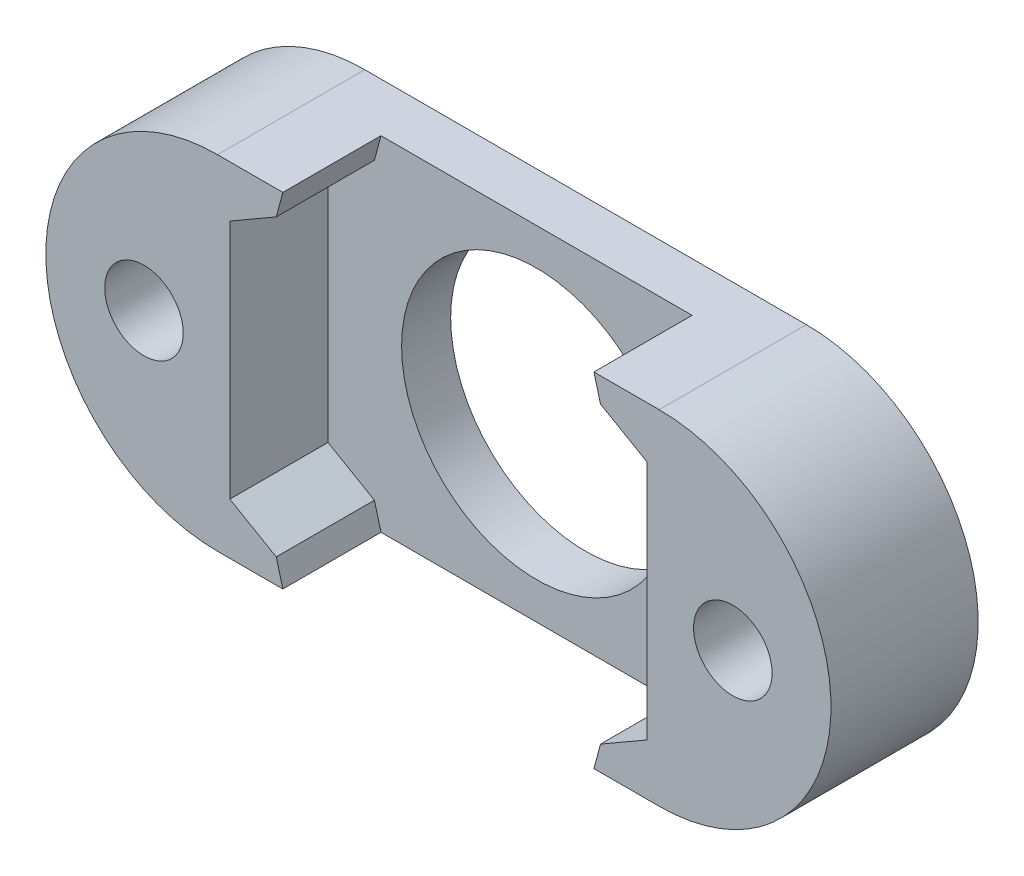
ISO-10303-21;
HEADER;
FILE_DESCRIPTION(('STEP AP214'),'2;1');
FILE_NAME('part.step','',(''),(''),'','','');
FILE_SCHEMA(('AUTOMOTIVE_DESIGN { 1 0 10303 214 1 1 1 1 }'));
ENDSEC;
DATA;
#1=APPLICATION_CONTEXT('core data for automotive mechanical design processes');
#2=APPLICATION_PROTOCOL_DEFINITION('international standard','automotive_design',2000,#1);
#3=PRODUCT_CONTEXT('',#1,'mechanical');
#4=PRODUCT('Part','Part','',(#3));
#5=PRODUCT_RELATED_PRODUCT_CATEGORY('part','',(#4));
#6=PRODUCT_DEFINITION_FORMATION('','',#4);
#7=PRODUCT_DEFINITION_CONTEXT('part definition',#1,'design');
#8=PRODUCT_DEFINITION('design','',#6,#7);
#9=PRODUCT_DEFINITION_SHAPE('','',#8);
#10=(LENGTH_UNIT() NAMED_UNIT(*) SI_UNIT(.MILLI.,.METRE.));
#11=(NAMED_UNIT(*) PLANE_ANGLE_UNIT() SI_UNIT($,.RADIAN.));
#12=(NAMED_UNIT(*) SI_UNIT($,.STERADIAN.) SOLID_ANGLE_UNIT());
#13=UNCERTAINTY_MEASURE_WITH_UNIT(LENGTH_MEASURE(1.E-05),#10,'distance_accuracy_value','');
#14=(GEOMETRIC_REPRESENTATION_CONTEXT(3) GLOBAL_UNCERTAINTY_ASSIGNED_CONTEXT((#13)) GLOBAL_UNIT_ASSIGNED_CONTEXT((#10,
#11,#12)) REPRESENTATION_CONTEXT('',''));
#15=CARTESIAN_POINT('',(0.,0.,0.));
#16=DIRECTION('',(0.,0.,1.));
#17=DIRECTION('',(1.,0.,0.));
#18=AXIS2_PLACEMENT_3D('',#15,#16,#17);
#19=CARTESIAN_POINT('',(-27.2541785109983,0.,6.));
#20=DIRECTION('',(0.,0.,1.));
#21=DIRECTION('',(1.,0.,0.));
#22=AXIS2_PLACEMENT_3D('',#19,#20,#21);
#23=PLANE('',#22);
#24=DIRECTION('',(1.,0.,0.));
#25=VECTOR('',#24,1.);
#26=CARTESIAN_POINT('',(-27.2541785109983,-7.,6.));
#27=LINE('',#26,#25);
#28=CARTESIAN_POINT('',(-27.2541785109983,-7.,6.));
#29=VERTEX_POINT('',#28);
#30=CARTESIAN_POINT('',(-24.5939244731539,-7.,6.));
#31=VERTEX_POINT('',#30);
#32=EDGE_CURVE('E224',#29,#31,#27,.T.);
#33=ORIENTED_EDGE('',*,*,#32,.T.);
#34=DIRECTION('',(0.258819045102524,-0.965925826289068,0.));
#35=VECTOR('',#34,1.);
#36=CARTESIAN_POINT('',(-26.5221277034295,0.196152422706628,6.));
#37=LINE('',#36,#35);
#38=CARTESIAN_POINT('',(-24.8618736655851,-6.,6.));
#39=VERTEX_POINT('',#38);
#40=EDGE_CURVE('E276',#31,#39,#37,.F.);
#41=ORIENTED_EDGE('',*,*,#40,.T.);
#42=DIRECTION('',(0.866025403784438,-0.5,0.));
#43=VECTOR('',#42,1.);
#44=CARTESIAN_POINT('',(-26.7541785109983,-4.90747728811182,6.));
#45=LINE('',#44,#43);
#46=CARTESIAN_POINT('',(-26.7541785109983,-4.90747728811182,6.));
#47=VERTEX_POINT('',#46);
#48=EDGE_CURVE('E155',#47,#39,#45,.T.);
#49=ORIENTED_EDGE('',*,*,#48,.F.);
#50=DIRECTION('',(0.,-1.,0.));
#51=VECTOR('',#50,1.);
#52=CARTESIAN_POINT('',(-26.7541785109983,4.90747728811182,6.));
#53=LINE('',#52,#51);
#54=CARTESIAN_POINT('',(-26.7541785109983,4.90747728811182,6.));
#55=VERTEX_POINT('',#54);
#56=EDGE_CURVE('E188',#55,#47,#53,.T.);
#57=ORIENTED_EDGE('',*,*,#56,.F.);
#58=DIRECTION('',(-0.866025403784439,-0.5,0.));
#59=VECTOR('',#58,1.);
#60=CARTESIAN_POINT('',(-18.2541785109983,9.81495457622364,6.));
#61=LINE('',#60,#59);
#62=CARTESIAN_POINT('',(-24.861873665585,6.00000000000001,6.));
#63=VERTEX_POINT('',#62);
#64=EDGE_CURVE('E186',#63,#55,#61,.T.);
#65=ORIENTED_EDGE('',*,*,#64,.F.);
#66=DIRECTION('',(-0.258819045102523,-0.965925826289068,0.));
#67=VECTOR('',#66,1.);
#68=CARTESIAN_POINT('',(-26.5221277034294,-0.196152422706632,6.));
#69=LINE('',#68,#67);
#70=CARTESIAN_POINT('',(-24.5939244731539,7.,6.));
#71=VERTEX_POINT('',#70);
#72=EDGE_CURVE('E274',#63,#71,#69,.F.);
#73=ORIENTED_EDGE('',*,*,#72,.T.);
#74=DIRECTION('',(-1.,0.,0.));
#75=VECTOR('',#74,1.);
#76=CARTESIAN_POINT('',(-27.2541785109983,7.,6.));
#77=LINE('',#76,#75);
#78=CARTESIAN_POINT('',(-27.2541785109983,7.,6.));
#79=VERTEX_POINT('',#78);
#80=EDGE_CURVE('E229',#71,#79,#77,.T.);
#81=ORIENTED_EDGE('',*,*,#80,.T.);
#82=CARTESIAN_POINT('',(-27.2541785109983,0.,6.));
#83=DIRECTION('',(0.,0.,1.));
#84=DIRECTION('',(1.,0.,0.));
#85=AXIS2_PLACEMENT_3D('',#82,#83,#84);
#86=CIRCLE('',#85,7.);
#87=EDGE_CURVE('E219',#79,#29,#86,.T.);
#88=ORIENTED_EDGE('',*,*,#87,.T.);
#89=EDGE_LOOP('',(#33,#41,#49,#57,#65,#73,#81,#88));
#90=FACE_BOUND('',#89,.T.);
#91=CARTESIAN_POINT('',(-30.2541785109983,0.,6.));
#92=DIRECTION('',(0.,0.,1.));
#93=DIRECTION('',(1.,0.,0.));
#94=AXIS2_PLACEMENT_3D('',#91,#92,#93);
#95=CIRCLE('',#94,1.60000000000001);
#96=CARTESIAN_POINT('',(-28.6541785109983,0.,6.));
#97=VERTEX_POINT('',#96);
#98=EDGE_CURVE('E207',#97,#97,#95,.T.);
#99=ORIENTED_EDGE('',*,*,#98,.F.);
#100=EDGE_LOOP('',(#99));
#101=FACE_BOUND('',#100,.T.);
#102=ADVANCED_FACE('F33',(#90,#101),#23,.T.);
#103=CARTESIAN_POINT('',(-18.2541785109983,0.,0.));
#104=DIRECTION('',(0.,0.,1.));
#105=DIRECTION('',(1.,0.,0.));
#106=AXIS2_PLACEMENT_3D('',#103,#104,#105);
#107=CYLINDRICAL_SURFACE('',#106,5.5);
#108=CARTESIAN_POINT('',(-18.2541785109983,0.,0.));
#109=DIRECTION('',(0.,0.,1.));
#110=DIRECTION('',(1.,0.,0.));
#111=AXIS2_PLACEMENT_3D('',#108,#109,#110);
#112=CIRCLE('',#111,5.5);
#113=CARTESIAN_POINT('',(-12.7541785109983,0.,0.));
#114=VERTEX_POINT('',#113);
#115=EDGE_CURVE('E213',#114,#114,#112,.T.);
#116=ORIENTED_EDGE('',*,*,#115,.F.);
#117=EDGE_LOOP('',(#116));
#118=FACE_BOUND('',#117,.T.);
#119=CARTESIAN_POINT('',(-18.2541785109983,0.,2.));
#120=DIRECTION('',(0.,0.,1.));
#121=DIRECTION('',(1.,0.,0.));
#122=AXIS2_PLACEMENT_3D('',#119,#120,#121);
#123=CIRCLE('',#122,5.5);
#124=CARTESIAN_POINT('',(-12.7541785109983,0.,2.));
#125=VERTEX_POINT('',#124);
#126=EDGE_CURVE('E194',#125,#125,#123,.F.);
#127=ORIENTED_EDGE('',*,*,#126,.F.);
#128=EDGE_LOOP('',(#127));
#129=FACE_BOUND('',#128,.T.);
#130=ADVANCED_FACE('F354',(#118,#129),#107,.F.);
#131=CARTESIAN_POINT('',(-27.2541785109983,0.,6.));
#132=DIRECTION('',(0.,0.,-1.));
#133=DIRECTION('',(-1.,0.,0.));
#134=AXIS2_PLACEMENT_3D('',#131,#132,#133);
#135=CYLINDRICAL_SURFACE('',#134,7.);
#136=CARTESIAN_POINT('',(-27.2541785109983,0.,0.));
#137=DIRECTION('',(0.,0.,1.));
#138=DIRECTION('',(1.,0.,0.));
#139=AXIS2_PLACEMENT_3D('',#136,#137,#138);
#140=CIRCLE('',#139,7.);
#141=CARTESIAN_POINT('',(-27.2541785109983,7.,0.));
#142=VERTEX_POINT('',#141);
#143=CARTESIAN_POINT('',(-27.2541785109983,-7.,0.));
#144=VERTEX_POINT('',#143);
#145=EDGE_CURVE('E218',#142,#144,#140,.T.);
#146=ORIENTED_EDGE('',*,*,#145,.T.);
#147=DIRECTION('',(0.,0.,-1.));
#148=VECTOR('',#147,1.);
#149=CARTESIAN_POINT('',(-27.2541785109983,-7.,6.));
#150=LINE('',#149,#148);
#151=EDGE_CURVE('E249',#29,#144,#150,.T.);
#152=ORIENTED_EDGE('',*,*,#151,.F.);
#153=ORIENTED_EDGE('',*,*,#87,.F.);
#154=DIRECTION('',(0.,0.,-1.));
#155=VECTOR('',#154,1.);
#156=CARTESIAN_POINT('',(-27.2541785109983,7.,6.));
#157=LINE('',#156,#155);
#158=EDGE_CURVE('E233',#79,#142,#157,.T.);
#159=ORIENTED_EDGE('',*,*,#158,.T.);
#160=EDGE_LOOP('',(#146,#152,#153,#159));
#161=FACE_BOUND('',#160,.T.);
#162=ADVANCED_FACE('F300',(#161),#135,.T.);
#163=CARTESIAN_POINT('',(-27.2541785109983,-7.,6.));
#164=DIRECTION('',(0.,1.,0.));
#165=DIRECTION('',(0.,0.,1.));
#166=AXIS2_PLACEMENT_3D('',#163,#164,#165);
#167=PLANE('',#166);
#168=CARTESIAN_POINT('',(-11.9144325488427,-7.,6.));
#169=VERTEX_POINT('',#168);
#170=CARTESIAN_POINT('',(-9.25417851099832,-7.,6.));
#171=VERTEX_POINT('',#170);
#172=EDGE_CURVE('E222',#169,#171,#27,.T.);
#173=ORIENTED_EDGE('',*,*,#172,.F.);
#174=DIRECTION('',(0.,0.,-1.));
#175=VECTOR('',#174,1.);
#176=CARTESIAN_POINT('',(-11.9144325488427,-7.,6.));
#177=LINE('',#176,#175);
#178=CARTESIAN_POINT('',(-11.9144325488427,-7.,2.));
#179=VERTEX_POINT('',#178);
#180=EDGE_CURVE('E257',#169,#179,#177,.T.);
#181=ORIENTED_EDGE('',*,*,#180,.T.);
#182=DIRECTION('',(1.,0.,0.));
#183=VECTOR('',#182,1.);
#184=CARTESIAN_POINT('',(-27.2541785109983,-7.,2.));
#185=LINE('',#184,#183);
#186=CARTESIAN_POINT('',(-24.5939244731539,-7.,2.));
#187=VERTEX_POINT('',#186);
#188=EDGE_CURVE('E201',#187,#179,#185,.T.);
#189=ORIENTED_EDGE('',*,*,#188,.F.);
#190=DIRECTION('',(0.,0.,1.));
#191=VECTOR('',#190,1.);
#192=CARTESIAN_POINT('',(-24.5939244731539,-7.,6.));
#193=LINE('',#192,#191);
#194=EDGE_CURVE('E252',#187,#31,#193,.T.);
#195=ORIENTED_EDGE('',*,*,#194,.T.);
#196=ORIENTED_EDGE('',*,*,#32,.F.);
#197=ORIENTED_EDGE('',*,*,#151,.T.);
#198=DIRECTION('',(1.,0.,0.));
#199=VECTOR('',#198,1.);
#200=CARTESIAN_POINT('',(-27.2541785109983,-7.,0.));
#201=LINE('',#200,#199);
#202=CARTESIAN_POINT('',(-9.25417851099832,-7.,0.));
#203=VERTEX_POINT('',#202);
#204=EDGE_CURVE('E236',#144,#203,#201,.T.);
#205=ORIENTED_EDGE('',*,*,#204,.T.);
#206=DIRECTION('',(0.,0.,-1.));
#207=VECTOR('',#206,1.);
#208=CARTESIAN_POINT('',(-9.25417851099832,-7.,6.));
#209=LINE('',#208,#207);
#210=EDGE_CURVE('E246',#171,#203,#209,.T.);
#211=ORIENTED_EDGE('',*,*,#210,.F.);
#212=EDGE_LOOP('',(#173,#181,#189,#195,#196,#197,#205,#211));
#213=FACE_BOUND('',#212,.T.);
#214=ADVANCED_FACE('F291',(#213),#167,.F.);
#215=CARTESIAN_POINT('',(-9.25417851099832,0.,6.));
#216=DIRECTION('',(0.,0.,-1.));
#217=DIRECTION('',(-1.,0.,0.));
#218=AXIS2_PLACEMENT_3D('',#215,#216,#217);
#219=CYLINDRICAL_SURFACE('',#218,7.);
#220=CARTESIAN_POINT('',(-9.25417851099832,0.,0.));
#221=DIRECTION('',(0.,0.,1.));
#222=DIRECTION('',(1.,0.,0.));
#223=AXIS2_PLACEMENT_3D('',#220,#221,#222);
#224=CIRCLE('',#223,7.);
#225=CARTESIAN_POINT('',(-9.25417851099832,7.,0.));
#226=VERTEX_POINT('',#225);
#227=EDGE_CURVE('E238',#203,#226,#224,.T.);
#228=ORIENTED_EDGE('',*,*,#227,.T.);
#229=DIRECTION('',(0.,0.,-1.));
#230=VECTOR('',#229,1.);
#231=CARTESIAN_POINT('',(-9.25417851099832,7.,6.));
#232=LINE('',#231,#230);
#233=CARTESIAN_POINT('',(-9.25417851099832,7.,6.));
#234=VERTEX_POINT('',#233);
#235=EDGE_CURVE('E243',#234,#226,#232,.T.);
#236=ORIENTED_EDGE('',*,*,#235,.F.);
#237=CARTESIAN_POINT('',(-9.25417851099832,0.,6.));
#238=DIRECTION('',(0.,0.,1.));
#239=DIRECTION('',(1.,0.,0.));
#240=AXIS2_PLACEMENT_3D('',#237,#238,#239);
#241=CIRCLE('',#240,7.);
#242=EDGE_CURVE('E227',#171,#234,#241,.T.);
#243=ORIENTED_EDGE('',*,*,#242,.F.);
#244=ORIENTED_EDGE('',*,*,#210,.T.);
#245=EDGE_LOOP('',(#228,#236,#243,#244));
#246=FACE_BOUND('',#245,.T.);
#247=ADVANCED_FACE('F307',(#246),#219,.T.);
#248=CARTESIAN_POINT('',(-27.2541785109983,7.,6.));
#249=DIRECTION('',(0.,-1.,0.));
#250=DIRECTION('',(0.,0.,-1.));
#251=AXIS2_PLACEMENT_3D('',#248,#249,#250);
#252=PLANE('',#251);
#253=DIRECTION('',(-1.,0.,0.));
#254=VECTOR('',#253,1.);
#255=CARTESIAN_POINT('',(-27.2541785109983,7.,2.));
#256=LINE('',#255,#254);
#257=CARTESIAN_POINT('',(-11.9144325488427,7.,2.));
#258=VERTEX_POINT('',#257);
#259=CARTESIAN_POINT('',(-24.5939244731539,7.,2.));
#260=VERTEX_POINT('',#259);
#261=EDGE_CURVE('E199',#258,#260,#256,.T.);
#262=ORIENTED_EDGE('',*,*,#261,.F.);
#263=DIRECTION('',(0.,0.,1.));
#264=VECTOR('',#263,1.);
#265=CARTESIAN_POINT('',(-11.9144325488427,7.,6.));
#266=LINE('',#265,#264);
#267=CARTESIAN_POINT('',(-11.9144325488427,7.,6.));
#268=VERTEX_POINT('',#267);
#269=EDGE_CURVE('E269',#258,#268,#266,.T.);
#270=ORIENTED_EDGE('',*,*,#269,.T.);
#271=EDGE_CURVE('E230',#234,#268,#77,.T.);
#272=ORIENTED_EDGE('',*,*,#271,.F.);
#273=ORIENTED_EDGE('',*,*,#235,.T.);
#274=DIRECTION('',(-1.,0.,0.));
#275=VECTOR('',#274,1.);
#276=CARTESIAN_POINT('',(-27.2541785109983,7.,0.));
#277=LINE('',#276,#275);
#278=EDGE_CURVE('E223',#226,#142,#277,.T.);
#279=ORIENTED_EDGE('',*,*,#278,.T.);
#280=ORIENTED_EDGE('',*,*,#158,.F.);
#281=ORIENTED_EDGE('',*,*,#80,.F.);
#282=DIRECTION('',(0.,0.,-1.));
#283=VECTOR('',#282,1.);
#284=CARTESIAN_POINT('',(-24.5939244731539,7.,6.));
#285=LINE('',#284,#283);
#286=EDGE_CURVE('E266',#71,#260,#285,.T.);
#287=ORIENTED_EDGE('',*,*,#286,.T.);
#288=EDGE_LOOP('',(#262,#270,#272,#273,#279,#280,#281,#287));
#289=FACE_BOUND('',#288,.T.);
#290=ADVANCED_FACE('F312',(#289),#252,.F.);
#291=DIRECTION('',(0.866025403784438,0.5,0.));
#292=VECTOR('',#291,1.);
#293=CARTESIAN_POINT('',(-18.2541785109983,-9.81495457622364,6.));
#294=LINE('',#293,#292);
#295=CARTESIAN_POINT('',(-11.6464833564116,-6.,6.));
#296=VERTEX_POINT('',#295);
#297=CARTESIAN_POINT('',(-9.75417851099832,-4.90747728811182,6.));
#298=VERTEX_POINT('',#297);
#299=EDGE_CURVE('E161',#296,#298,#294,.T.);
#300=ORIENTED_EDGE('',*,*,#299,.F.);
#301=DIRECTION('',(0.258819045102522,0.965925826289068,0.));
#302=VECTOR('',#301,1.);
#303=CARTESIAN_POINT('',(-11.1920006845072,-4.3038475772934,6.));
#304=LINE('',#303,#302);
#305=EDGE_CURVE('E264',#296,#169,#304,.F.);
#306=ORIENTED_EDGE('',*,*,#305,.T.);
#307=ORIENTED_EDGE('',*,*,#172,.T.);
#308=ORIENTED_EDGE('',*,*,#242,.T.);
#309=ORIENTED_EDGE('',*,*,#271,.T.);
#310=DIRECTION('',(-0.258819045102526,0.965925826289067,0.));
#311=VECTOR('',#310,1.);
#312=CARTESIAN_POINT('',(-11.1920006845072,4.30384757729345,6.));
#313=LINE('',#312,#311);
#314=CARTESIAN_POINT('',(-11.6464833564116,5.99999999999999,6.));
#315=VERTEX_POINT('',#314);
#316=EDGE_CURVE('E262',#268,#315,#313,.F.);
#317=ORIENTED_EDGE('',*,*,#316,.T.);
#318=DIRECTION('',(-0.866025403784439,0.5,0.));
#319=VECTOR('',#318,1.);
#320=CARTESIAN_POINT('',(-9.75417851099832,4.90747728811182,6.));
#321=LINE('',#320,#319);
#322=CARTESIAN_POINT('',(-9.75417851099832,4.90747728811182,6.));
#323=VERTEX_POINT('',#322);
#324=EDGE_CURVE('E183',#323,#315,#321,.T.);
#325=ORIENTED_EDGE('',*,*,#324,.F.);
#326=DIRECTION('',(0.,1.,0.));
#327=VECTOR('',#326,1.);
#328=CARTESIAN_POINT('',(-9.75417851099832,-4.90747728811182,6.));
#329=LINE('',#328,#327);
#330=EDGE_CURVE('E181',#298,#323,#329,.T.);
#331=ORIENTED_EDGE('',*,*,#330,.F.);
#332=EDGE_LOOP('',(#300,#306,#307,#308,#309,#317,#325,#331));
#333=FACE_BOUND('',#332,.T.);
#334=CARTESIAN_POINT('',(-6.25417851099832,0.,6.));
#335=DIRECTION('',(0.,0.,1.));
#336=DIRECTION('',(1.,0.,0.));
#337=AXIS2_PLACEMENT_3D('',#334,#335,#336);
#338=CIRCLE('',#337,1.6);
#339=CARTESIAN_POINT('',(-4.65417851099832,0.,6.));
#340=VERTEX_POINT('',#339);
#341=EDGE_CURVE('E203',#340,#340,#338,.T.);
#342=ORIENTED_EDGE('',*,*,#341,.F.);
#343=EDGE_LOOP('',(#342));
#344=FACE_BOUND('',#343,.T.);
#345=ADVANCED_FACE('F316',(#333,#344),#23,.T.);
#346=CARTESIAN_POINT('',(-27.2541785109983,0.,0.));
#347=DIRECTION('',(0.,0.,1.));
#348=DIRECTION('',(1.,0.,0.));
#349=AXIS2_PLACEMENT_3D('',#346,#347,#348);
#350=PLANE('',#349);
#351=CARTESIAN_POINT('',(-6.25417851099832,0.,0.));
#352=DIRECTION('',(0.,0.,1.));
#353=DIRECTION('',(1.,0.,0.));
#354=AXIS2_PLACEMENT_3D('',#351,#352,#353);
#355=CIRCLE('',#354,1.6);
#356=CARTESIAN_POINT('',(-4.65417851099832,0.,0.));
#357=VERTEX_POINT('',#356);
#358=EDGE_CURVE('E204',#357,#357,#355,.T.);
#359=ORIENTED_EDGE('',*,*,#358,.T.);
#360=EDGE_LOOP('',(#359));
#361=FACE_BOUND('',#360,.T.);
#362=CARTESIAN_POINT('',(-30.2541785109983,0.,0.));
#363=DIRECTION('',(0.,0.,1.));
#364=DIRECTION('',(1.,0.,0.));
#365=AXIS2_PLACEMENT_3D('',#362,#363,#364);
#366=CIRCLE('',#365,1.60000000000001);
#367=CARTESIAN_POINT('',(-28.6541785109983,0.,0.));
#368=VERTEX_POINT('',#367);
#369=EDGE_CURVE('E210',#368,#368,#366,.T.);
#370=ORIENTED_EDGE('',*,*,#369,.T.);
#371=EDGE_LOOP('',(#370));
#372=FACE_BOUND('',#371,.T.);
#373=ORIENTED_EDGE('',*,*,#115,.T.);
#374=EDGE_LOOP('',(#373));
#375=FACE_BOUND('',#374,.T.);
#376=ORIENTED_EDGE('',*,*,#145,.F.);
#377=ORIENTED_EDGE('',*,*,#278,.F.);
#378=ORIENTED_EDGE('',*,*,#227,.F.);
#379=ORIENTED_EDGE('',*,*,#204,.F.);
#380=EDGE_LOOP('',(#376,#377,#378,#379));
#381=FACE_BOUND('',#380,.T.);
#382=ADVANCED_FACE('F310',(#361,#372,#375,#381),#350,.F.);
#383=CARTESIAN_POINT('',(-30.2541785109983,0.,0.));
#384=DIRECTION('',(0.,0.,1.));
#385=DIRECTION('',(1.,0.,0.));
#386=AXIS2_PLACEMENT_3D('',#383,#384,#385);
#387=CYLINDRICAL_SURFACE('',#386,1.60000000000001);
#388=ORIENTED_EDGE('',*,*,#369,.F.);
#389=EDGE_LOOP('',(#388));
#390=FACE_BOUND('',#389,.T.);
#391=ORIENTED_EDGE('',*,*,#98,.T.);
#392=EDGE_LOOP('',(#391));
#393=FACE_BOUND('',#392,.T.);
#394=ADVANCED_FACE('F367',(#390,#393),#387,.F.);
#395=CARTESIAN_POINT('',(-6.25417851099832,0.,0.));
#396=DIRECTION('',(0.,0.,1.));
#397=DIRECTION('',(1.,0.,0.));
#398=AXIS2_PLACEMENT_3D('',#395,#396,#397);
#399=CYLINDRICAL_SURFACE('',#398,1.6);
#400=ORIENTED_EDGE('',*,*,#358,.F.);
#401=EDGE_LOOP('',(#400));
#402=FACE_BOUND('',#401,.T.);
#403=ORIENTED_EDGE('',*,*,#341,.T.);
#404=EDGE_LOOP('',(#403));
#405=FACE_BOUND('',#404,.T.);
#406=ADVANCED_FACE('F349',(#402,#405),#399,.F.);
#407=CARTESIAN_POINT('',(-18.2541785109983,-9.81495457622364,2.));
#408=DIRECTION('',(0.5,-0.866025403784439,0.));
#409=DIRECTION('',(0.866025403784439,0.5,0.));
#410=AXIS2_PLACEMENT_3D('',#407,#408,#409);
#411=PLANE('',#410);
#412=DIRECTION('',(0.866025403784438,0.5,0.));
#413=VECTOR('',#412,1.);
#414=CARTESIAN_POINT('',(-18.2541785109983,-9.81495457622364,2.));
#415=LINE('',#414,#413);
#416=CARTESIAN_POINT('',(-11.6464833564116,-6.,2.));
#417=VERTEX_POINT('',#416);
#418=CARTESIAN_POINT('',(-9.75417851099832,-4.90747728811182,2.));
#419=VERTEX_POINT('',#418);
#420=EDGE_CURVE('E145',#417,#419,#415,.T.);
#421=ORIENTED_EDGE('',*,*,#420,.F.);
#422=DIRECTION('',(0.,0.,1.));
#423=VECTOR('',#422,1.);
#424=CARTESIAN_POINT('',(-11.6464833564116,-6.,2.));
#425=LINE('',#424,#423);
#426=EDGE_CURVE('E260',#417,#296,#425,.T.);
#427=ORIENTED_EDGE('',*,*,#426,.T.);
#428=ORIENTED_EDGE('',*,*,#299,.T.);
#429=DIRECTION('',(0.,0.,1.));
#430=VECTOR('',#429,1.);
#431=CARTESIAN_POINT('',(-9.75417851099832,-4.90747728811182,2.));
#432=LINE('',#431,#430);
#433=EDGE_CURVE('E158',#419,#298,#432,.T.);
#434=ORIENTED_EDGE('',*,*,#433,.F.);
#435=EDGE_LOOP('',(#421,#427,#428,#434));
#436=FACE_BOUND('',#435,.T.);
#437=ADVANCED_FACE('F159',(#436),#411,.F.);
#438=CARTESIAN_POINT('',(-26.7541785109983,-4.90747728811182,2.));
#439=DIRECTION('',(-0.5,-0.866025403784439,0.));
#440=DIRECTION('',(0.866025403784439,-0.5,0.));
#441=AXIS2_PLACEMENT_3D('',#438,#439,#440);
#442=PLANE('',#441);
#443=ORIENTED_EDGE('',*,*,#48,.T.);
#444=DIRECTION('',(0.,0.,-1.));
#445=VECTOR('',#444,1.);
#446=CARTESIAN_POINT('',(-24.8618736655851,-6.,2.));
#447=LINE('',#446,#445);
#448=CARTESIAN_POINT('',(-24.8618736655851,-6.,2.));
#449=VERTEX_POINT('',#448);
#450=EDGE_CURVE('E54',#39,#449,#447,.T.);
#451=ORIENTED_EDGE('',*,*,#450,.T.);
#452=DIRECTION('',(0.866025403784438,-0.5,0.));
#453=VECTOR('',#452,1.);
#454=CARTESIAN_POINT('',(-26.7541785109983,-4.90747728811182,2.));
#455=LINE('',#454,#453);
#456=CARTESIAN_POINT('',(-26.7541785109983,-4.90747728811182,2.));
#457=VERTEX_POINT('',#456);
#458=EDGE_CURVE('E166',#457,#449,#455,.T.);
#459=ORIENTED_EDGE('',*,*,#458,.F.);
#460=DIRECTION('',(0.,0.,1.));
#461=VECTOR('',#460,1.);
#462=CARTESIAN_POINT('',(-26.7541785109983,-4.90747728811182,2.));
#463=LINE('',#462,#461);
#464=EDGE_CURVE('E192',#457,#47,#463,.T.);
#465=ORIENTED_EDGE('',*,*,#464,.T.);
#466=EDGE_LOOP('',(#443,#451,#459,#465));
#467=FACE_BOUND('',#466,.T.);
#468=ADVANCED_FACE('F341',(#467),#442,.F.);
#469=CARTESIAN_POINT('',(-18.2541785109983,9.81495457622364,2.));
#470=DIRECTION('',(-0.5,0.866025403784439,0.));
#471=DIRECTION('',(-0.866025403784439,-0.5,0.));
#472=AXIS2_PLACEMENT_3D('',#469,#470,#471);
#473=PLANE('',#472);
#474=DIRECTION('',(-0.866025403784439,-0.5,0.));
#475=VECTOR('',#474,1.);
#476=CARTESIAN_POINT('',(-18.2541785109983,9.81495457622364,2.));
#477=LINE('',#476,#475);
#478=CARTESIAN_POINT('',(-24.861873665585,6.00000000000001,2.));
#479=VERTEX_POINT('',#478);
#480=CARTESIAN_POINT('',(-26.7541785109983,4.90747728811182,2.));
#481=VERTEX_POINT('',#480);
#482=EDGE_CURVE('E172',#479,#481,#477,.T.);
#483=ORIENTED_EDGE('',*,*,#482,.F.);
#484=DIRECTION('',(0.,0.,1.));
#485=VECTOR('',#484,1.);
#486=CARTESIAN_POINT('',(-24.861873665585,6.00000000000001,2.));
#487=LINE('',#486,#485);
#488=EDGE_CURVE('E279',#479,#63,#487,.T.);
#489=ORIENTED_EDGE('',*,*,#488,.T.);
#490=ORIENTED_EDGE('',*,*,#64,.T.);
#491=DIRECTION('',(0.,0.,1.));
#492=VECTOR('',#491,1.);
#493=CARTESIAN_POINT('',(-26.7541785109983,4.90747728811182,2.));
#494=LINE('',#493,#492);
#495=EDGE_CURVE('E195',#481,#55,#494,.T.);
#496=ORIENTED_EDGE('',*,*,#495,.F.);
#497=EDGE_LOOP('',(#483,#489,#490,#496));
#498=FACE_BOUND('',#497,.T.);
#499=ADVANCED_FACE('F335',(#498),#473,.F.);
#500=CARTESIAN_POINT('',(-9.75417851099832,4.90747728811182,2.));
#501=DIRECTION('',(0.5,0.866025403784439,0.));
#502=DIRECTION('',(-0.866025403784439,0.5,0.));
#503=AXIS2_PLACEMENT_3D('',#500,#501,#502);
#504=PLANE('',#503);
#505=ORIENTED_EDGE('',*,*,#324,.T.);
#506=DIRECTION('',(0.,0.,-1.));
#507=VECTOR('',#506,1.);
#508=CARTESIAN_POINT('',(-11.6464833564116,5.99999999999999,2.));
#509=LINE('',#508,#507);
#510=CARTESIAN_POINT('',(-11.6464833564116,5.99999999999999,2.));
#511=VERTEX_POINT('',#510);
#512=EDGE_CURVE('E272',#315,#511,#509,.T.);
#513=ORIENTED_EDGE('',*,*,#512,.T.);
#514=DIRECTION('',(-0.866025403784439,0.5,0.));
#515=VECTOR('',#514,1.);
#516=CARTESIAN_POINT('',(-9.75417851099832,4.90747728811182,2.));
#517=LINE('',#516,#515);
#518=CARTESIAN_POINT('',(-9.75417851099832,4.90747728811182,2.));
#519=VERTEX_POINT('',#518);
#520=EDGE_CURVE('E170',#519,#511,#517,.T.);
#521=ORIENTED_EDGE('',*,*,#520,.F.);
#522=DIRECTION('',(0.,0.,1.));
#523=VECTOR('',#522,1.);
#524=CARTESIAN_POINT('',(-9.75417851099832,4.90747728811182,2.));
#525=LINE('',#524,#523);
#526=EDGE_CURVE('E165',#519,#323,#525,.T.);
#527=ORIENTED_EDGE('',*,*,#526,.T.);
#528=EDGE_LOOP('',(#505,#513,#521,#527));
#529=FACE_BOUND('',#528,.T.);
#530=ADVANCED_FACE('F325',(#529),#504,.F.);
#531=CARTESIAN_POINT('',(0.,0.,2.));
#532=DIRECTION('',(0.,0.,1.));
#533=DIRECTION('',(1.,0.,0.));
#534=AXIS2_PLACEMENT_3D('',#531,#532,#533);
#535=PLANE('',#534);
#536=ORIENTED_EDGE('',*,*,#126,.T.);
#537=EDGE_LOOP('',(#536));
#538=FACE_BOUND('',#537,.T.);
#539=ORIENTED_EDGE('',*,*,#188,.T.);
#540=DIRECTION('',(-0.258819045102522,-0.965925826289068,0.));
#541=VECTOR('',#540,1.);
#542=CARTESIAN_POINT('',(-11.9144325488427,-7.,2.));
#543=LINE('',#542,#541);
#544=EDGE_CURVE('E152',#179,#417,#543,.F.);
#545=ORIENTED_EDGE('',*,*,#544,.T.);
#546=ORIENTED_EDGE('',*,*,#420,.T.);
#547=DIRECTION('',(0.,1.,0.));
#548=VECTOR('',#547,1.);
#549=CARTESIAN_POINT('',(-9.75417851099832,-4.90747728811182,2.));
#550=LINE('',#549,#548);
#551=EDGE_CURVE('E150',#419,#519,#550,.T.);
#552=ORIENTED_EDGE('',*,*,#551,.T.);
#553=ORIENTED_EDGE('',*,*,#520,.T.);
#554=DIRECTION('',(0.258819045102526,-0.965925826289067,0.));
#555=VECTOR('',#554,1.);
#556=CARTESIAN_POINT('',(-11.9144325488427,7.,2.));
#557=LINE('',#556,#555);
#558=EDGE_CURVE('E282',#511,#258,#557,.F.);
#559=ORIENTED_EDGE('',*,*,#558,.T.);
#560=ORIENTED_EDGE('',*,*,#261,.T.);
#561=DIRECTION('',(0.258819045102523,0.965925826289068,0.));
#562=VECTOR('',#561,1.);
#563=CARTESIAN_POINT('',(-24.5939244731539,7.,2.));
#564=LINE('',#563,#562);
#565=EDGE_CURVE('E11',#260,#479,#564,.F.);
#566=ORIENTED_EDGE('',*,*,#565,.T.);
#567=ORIENTED_EDGE('',*,*,#482,.T.);
#568=DIRECTION('',(0.,-1.,0.));
#569=VECTOR('',#568,1.);
#570=CARTESIAN_POINT('',(-26.7541785109983,4.90747728811182,2.));
#571=LINE('',#570,#569);
#572=EDGE_CURVE('E176',#481,#457,#571,.T.);
#573=ORIENTED_EDGE('',*,*,#572,.T.);
#574=ORIENTED_EDGE('',*,*,#458,.T.);
#575=DIRECTION('',(-0.258819045102524,0.965925826289068,0.));
#576=VECTOR('',#575,1.);
#577=CARTESIAN_POINT('',(-24.5939244731539,-7.,2.));
#578=LINE('',#577,#576);
#579=EDGE_CURVE('E41',#449,#187,#578,.F.);
#580=ORIENTED_EDGE('',*,*,#579,.T.);
#581=EDGE_LOOP('',(#539,#545,#546,#552,#553,#559,#560,#566,#567,#573,#574,#580));
#582=FACE_BOUND('',#581,.T.);
#583=ADVANCED_FACE('F147',(#538,#582),#535,.T.);
#584=CARTESIAN_POINT('',(-26.7541785109983,4.90747728811182,2.));
#585=DIRECTION('',(-1.,0.,0.));
#586=DIRECTION('',(0.,0.,1.));
#587=AXIS2_PLACEMENT_3D('',#584,#585,#586);
#588=PLANE('',#587);
#589=ORIENTED_EDGE('',*,*,#56,.T.);
#590=ORIENTED_EDGE('',*,*,#464,.F.);
#591=ORIENTED_EDGE('',*,*,#572,.F.);
#592=ORIENTED_EDGE('',*,*,#495,.T.);
#593=EDGE_LOOP('',(#589,#590,#591,#592));
#594=FACE_BOUND('',#593,.T.);
#595=ADVANCED_FACE('F339',(#594),#588,.F.);
#596=CARTESIAN_POINT('',(-9.75417851099832,-4.90747728811182,2.));
#597=DIRECTION('',(1.,0.,0.));
#598=DIRECTION('',(0.,0.,-1.));
#599=AXIS2_PLACEMENT_3D('',#596,#597,#598);
#600=PLANE('',#599);
#601=ORIENTED_EDGE('',*,*,#330,.T.);
#602=ORIENTED_EDGE('',*,*,#526,.F.);
#603=ORIENTED_EDGE('',*,*,#551,.F.);
#604=ORIENTED_EDGE('',*,*,#433,.T.);
#605=EDGE_LOOP('',(#601,#602,#603,#604));
#606=FACE_BOUND('',#605,.T.);
#607=ADVANCED_FACE('F168',(#606),#600,.F.);
#608=CARTESIAN_POINT('',(-11.9144325488427,-7.,6.));
#609=DIRECTION('',(0.965925826289068,-0.258819045102522,0.));
#610=DIRECTION('',(0.,0.,-1.));
#611=AXIS2_PLACEMENT_3D('',#608,#609,#610);
#612=PLANE('',#611);
#613=ORIENTED_EDGE('',*,*,#305,.F.);
#614=ORIENTED_EDGE('',*,*,#426,.F.);
#615=ORIENTED_EDGE('',*,*,#544,.F.);
#616=ORIENTED_EDGE('',*,*,#180,.F.);
#617=EDGE_LOOP('',(#613,#614,#615,#616));
#618=FACE_BOUND('',#617,.T.);
#619=ADVANCED_FACE('F322',(#618),#612,.F.);
#620=CARTESIAN_POINT('',(-11.9144325488427,7.,6.));
#621=DIRECTION('',(0.965925826289067,0.258819045102525,0.));
#622=DIRECTION('',(0.,0.,1.));
#623=AXIS2_PLACEMENT_3D('',#620,#621,#622);
#624=PLANE('',#623);
#625=ORIENTED_EDGE('',*,*,#558,.F.);
#626=ORIENTED_EDGE('',*,*,#512,.F.);
#627=ORIENTED_EDGE('',*,*,#316,.F.);
#628=ORIENTED_EDGE('',*,*,#269,.F.);
#629=EDGE_LOOP('',(#625,#626,#627,#628));
#630=FACE_BOUND('',#629,.T.);
#631=ADVANCED_FACE('F328',(#630),#624,.F.);
#632=CARTESIAN_POINT('',(-24.5939244731539,-7.,6.));
#633=DIRECTION('',(-0.965925826289067,-0.258819045102524,0.));
#634=DIRECTION('',(0.,0.,1.));
#635=AXIS2_PLACEMENT_3D('',#632,#633,#634);
#636=PLANE('',#635);
#637=ORIENTED_EDGE('',*,*,#579,.F.);
#638=ORIENTED_EDGE('',*,*,#450,.F.);
#639=ORIENTED_EDGE('',*,*,#40,.F.);
#640=ORIENTED_EDGE('',*,*,#194,.F.);
#641=EDGE_LOOP('',(#637,#638,#639,#640));
#642=FACE_BOUND('',#641,.T.);
#643=ADVANCED_FACE('F288',(#642),#636,.F.);
#644=CARTESIAN_POINT('',(-24.5939244731539,7.,6.));
#645=DIRECTION('',(-0.965925826289068,0.258819045102523,0.));
#646=DIRECTION('',(0.,0.,-1.));
#647=AXIS2_PLACEMENT_3D('',#644,#645,#646);
#648=PLANE('',#647);
#649=ORIENTED_EDGE('',*,*,#72,.F.);
#650=ORIENTED_EDGE('',*,*,#488,.F.);
#651=ORIENTED_EDGE('',*,*,#565,.F.);
#652=ORIENTED_EDGE('',*,*,#286,.F.);
#653=EDGE_LOOP('',(#649,#650,#651,#652));
#654=FACE_BOUND('',#653,.T.);
#655=ADVANCED_FACE('F35',(#654),#648,.F.);
#656=CLOSED_SHELL('',(#102,#130,#162,#214,#247,#290,#345,#382,#394,#406,#437,#468,#499,#530,
#583,#595,#607,#619,#631,#643,#655));
#657=MANIFOLD_SOLID_BREP('B2',#656);
#658=ADVANCED_BREP_SHAPE_REPRESENTATION('',(#18,#657),#14);
#659=SHAPE_DEFINITION_REPRESENTATION(#9,#658);
ENDSEC;
END-ISO-10303-21;
